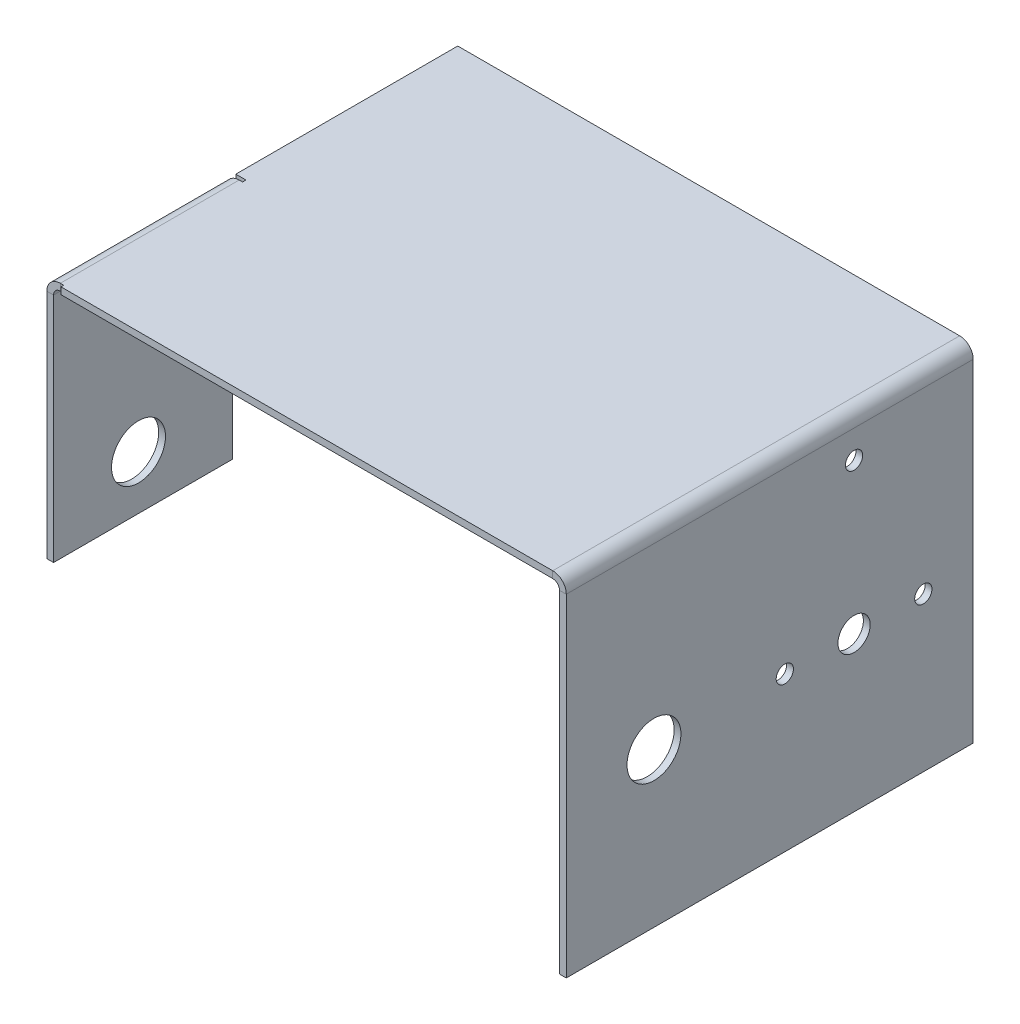
ISO-10303-21;
HEADER;
FILE_DESCRIPTION(('STEP AP214'),'2;1');
FILE_NAME('part.step','',(''),(''),'','','');
FILE_SCHEMA(('AUTOMOTIVE_DESIGN { 1 0 10303 214 1 1 1 1 }'));
ENDSEC;
DATA;
#1=APPLICATION_CONTEXT('core data for automotive mechanical design processes');
#2=APPLICATION_PROTOCOL_DEFINITION('international standard','automotive_design',2000,#1);
#3=PRODUCT_CONTEXT('',#1,'mechanical');
#4=PRODUCT('Part','Part','',(#3));
#5=PRODUCT_RELATED_PRODUCT_CATEGORY('part','',(#4));
#6=PRODUCT_DEFINITION_FORMATION('','',#4);
#7=PRODUCT_DEFINITION_CONTEXT('part definition',#1,'design');
#8=PRODUCT_DEFINITION('design','',#6,#7);
#9=PRODUCT_DEFINITION_SHAPE('','',#8);
#10=(LENGTH_UNIT() NAMED_UNIT(*) SI_UNIT(.MILLI.,.METRE.));
#11=(NAMED_UNIT(*) PLANE_ANGLE_UNIT() SI_UNIT($,.RADIAN.));
#12=(NAMED_UNIT(*) SI_UNIT($,.STERADIAN.) SOLID_ANGLE_UNIT());
#13=UNCERTAINTY_MEASURE_WITH_UNIT(LENGTH_MEASURE(1.E-05),#10,'distance_accuracy_value','');
#14=(GEOMETRIC_REPRESENTATION_CONTEXT(3) GLOBAL_UNCERTAINTY_ASSIGNED_CONTEXT((#13)) GLOBAL_UNIT_ASSIGNED_CONTEXT((#10,
#11,#12)) REPRESENTATION_CONTEXT('',''));
#15=CARTESIAN_POINT('',(0.,0.,0.));
#16=DIRECTION('',(0.,0.,1.));
#17=DIRECTION('',(1.,0.,0.));
#18=AXIS2_PLACEMENT_3D('',#15,#16,#17);
#19=CARTESIAN_POINT('',(0.,-1.,0.));
#20=DIRECTION('',(0.,1.,0.));
#21=DIRECTION('',(0.,0.,-1.));
#22=AXIS2_PLACEMENT_3D('',#19,#20,#21);
#23=PLANE('',#22);
#24=DIRECTION('',(0.,0.,-1.));
#25=VECTOR('',#24,1.);
#26=CARTESIAN_POINT('',(-36.,-0.99999999999999,30.094208410316));
#27=LINE('',#26,#25);
#28=CARTESIAN_POINT('',(-36.,-0.99999999999999,30.));
#29=VERTEX_POINT('',#28);
#30=CARTESIAN_POINT('',(-36.,-0.99999999999999,29.594208410316));
#31=VERTEX_POINT('',#30);
#32=EDGE_CURVE('E219',#29,#31,#27,.T.);
#33=ORIENTED_EDGE('',*,*,#32,.T.);
#34=DIRECTION('',(-1.,0.,0.));
#35=VECTOR('',#34,1.);
#36=CARTESIAN_POINT('',(-36.,-0.99999999999999,29.594208410316));
#37=LINE('',#36,#35);
#38=CARTESIAN_POINT('',(-36.5,-0.99999999999999,29.594208410316));
#39=VERTEX_POINT('',#38);
#40=EDGE_CURVE('E223',#31,#39,#37,.T.);
#41=ORIENTED_EDGE('',*,*,#40,.T.);
#42=DIRECTION('',(0.,0.,1.));
#43=VECTOR('',#42,1.);
#44=CARTESIAN_POINT('',(-36.5,-0.99999999999999,29.594208410316));
#45=LINE('',#44,#43);
#46=CARTESIAN_POINT('',(-36.5,-0.99999999999999,3.22486828633828));
#47=VERTEX_POINT('',#46);
#48=EDGE_CURVE('E209',#39,#47,#45,.F.);
#49=ORIENTED_EDGE('',*,*,#48,.T.);
#50=DIRECTION('',(1.,0.,0.));
#51=VECTOR('',#50,1.);
#52=CARTESIAN_POINT('',(-36.5,-0.99999999999999,3.22486828633828));
#53=LINE('',#52,#51);
#54=CARTESIAN_POINT('',(-36.,-0.99999999999999,3.22486828633828));
#55=VERTEX_POINT('',#54);
#56=EDGE_CURVE('E227',#47,#55,#53,.T.);
#57=ORIENTED_EDGE('',*,*,#56,.T.);
#58=DIRECTION('',(0.,0.,-1.));
#59=VECTOR('',#58,1.);
#60=CARTESIAN_POINT('',(-36.,-0.99999999999999,3.22486828633828));
#61=LINE('',#60,#59);
#62=CARTESIAN_POINT('',(-36.,-0.99999999999999,2.72486828633828));
#63=VERTEX_POINT('',#62);
#64=EDGE_CURVE('E230',#55,#63,#61,.T.);
#65=ORIENTED_EDGE('',*,*,#64,.T.);
#66=DIRECTION('',(-1.,0.,0.));
#67=VECTOR('',#66,1.);
#68=CARTESIAN_POINT('',(-36.,-0.99999999999999,2.72486828633828));
#69=LINE('',#68,#67);
#70=CARTESIAN_POINT('',(-37.5,-0.999999999999995,2.72486828633828));
#71=VERTEX_POINT('',#70);
#72=EDGE_CURVE('E234',#63,#71,#69,.T.);
#73=ORIENTED_EDGE('',*,*,#72,.T.);
#74=DIRECTION('',(0.,0.,-1.));
#75=VECTOR('',#74,1.);
#76=CARTESIAN_POINT('',(-37.5,-1.,-30.));
#77=LINE('',#76,#75);
#78=CARTESIAN_POINT('',(-37.5,-1.,-30.));
#79=VERTEX_POINT('',#78);
#80=EDGE_CURVE('E297',#71,#79,#77,.T.);
#81=ORIENTED_EDGE('',*,*,#80,.T.);
#82=DIRECTION('',(1.,0.,0.));
#83=VECTOR('',#82,1.);
#84=CARTESIAN_POINT('',(37.5,-1.,-30.));
#85=LINE('',#84,#83);
#86=CARTESIAN_POINT('',(36.5,-0.999999999999997,-30.));
#87=VERTEX_POINT('',#86);
#88=EDGE_CURVE('E300',#79,#87,#85,.T.);
#89=ORIENTED_EDGE('',*,*,#88,.T.);
#90=DIRECTION('',(0.,0.,-1.));
#91=VECTOR('',#90,1.);
#92=CARTESIAN_POINT('',(36.5,-0.999999999999997,-30.));
#93=LINE('',#92,#91);
#94=CARTESIAN_POINT('',(36.5,-0.999999999999997,30.));
#95=VERTEX_POINT('',#94);
#96=EDGE_CURVE('E288',#87,#95,#93,.F.);
#97=ORIENTED_EDGE('',*,*,#96,.T.);
#98=DIRECTION('',(-1.,0.,0.));
#99=VECTOR('',#98,1.);
#100=CARTESIAN_POINT('',(37.5,-1.,30.));
#101=LINE('',#100,#99);
#102=EDGE_CURVE('E304',#95,#29,#101,.T.);
#103=ORIENTED_EDGE('',*,*,#102,.T.);
#104=EDGE_LOOP('',(#33,#41,#49,#57,#65,#73,#81,#89,#97,#103));
#105=FACE_BOUND('',#104,.T.);
#106=ADVANCED_FACE('F38',(#105),#23,.F.);
#107=CARTESIAN_POINT('',(0.,0.,0.));
#108=DIRECTION('',(0.,1.,0.));
#109=DIRECTION('',(0.,0.,-1.));
#110=AXIS2_PLACEMENT_3D('',#107,#108,#109);
#111=PLANE('',#110);
#112=DIRECTION('',(-1.,0.,0.));
#113=VECTOR('',#112,1.);
#114=CARTESIAN_POINT('',(37.5,0.,30.));
#115=LINE('',#114,#113);
#116=CARTESIAN_POINT('',(36.5,0.,30.));
#117=VERTEX_POINT('',#116);
#118=CARTESIAN_POINT('',(-36.,0.,30.));
#119=VERTEX_POINT('',#118);
#120=EDGE_CURVE('E301',#117,#119,#115,.T.);
#121=ORIENTED_EDGE('',*,*,#120,.F.);
#122=DIRECTION('',(0.,0.,-1.));
#123=VECTOR('',#122,1.);
#124=CARTESIAN_POINT('',(36.5,0.,-30.));
#125=LINE('',#124,#123);
#126=CARTESIAN_POINT('',(36.5,0.,-30.));
#127=VERTEX_POINT('',#126);
#128=EDGE_CURVE('E278',#127,#117,#125,.F.);
#129=ORIENTED_EDGE('',*,*,#128,.F.);
#130=DIRECTION('',(1.,0.,0.));
#131=VECTOR('',#130,1.);
#132=CARTESIAN_POINT('',(37.5,0.,-30.));
#133=LINE('',#132,#131);
#134=CARTESIAN_POINT('',(-37.5,0.,-30.));
#135=VERTEX_POINT('',#134);
#136=EDGE_CURVE('E310',#135,#127,#133,.T.);
#137=ORIENTED_EDGE('',*,*,#136,.F.);
#138=DIRECTION('',(0.,0.,-1.));
#139=VECTOR('',#138,1.);
#140=CARTESIAN_POINT('',(-37.5,0.,-30.));
#141=LINE('',#140,#139);
#142=CARTESIAN_POINT('',(-37.5,0.,2.72486828633828));
#143=VERTEX_POINT('',#142);
#144=EDGE_CURVE('E294',#143,#135,#141,.T.);
#145=ORIENTED_EDGE('',*,*,#144,.F.);
#146=DIRECTION('',(-1.,0.,0.));
#147=VECTOR('',#146,1.);
#148=CARTESIAN_POINT('',(0.,0.,2.72486828633825));
#149=LINE('',#148,#147);
#150=CARTESIAN_POINT('',(-36.,0.,2.72486828633828));
#151=VERTEX_POINT('',#150);
#152=EDGE_CURVE('E243',#151,#143,#149,.T.);
#153=ORIENTED_EDGE('',*,*,#152,.F.);
#154=DIRECTION('',(0.,0.,-1.));
#155=VECTOR('',#154,1.);
#156=CARTESIAN_POINT('',(-36.,0.,0.));
#157=LINE('',#156,#155);
#158=CARTESIAN_POINT('',(-36.,0.,3.22486828633828));
#159=VERTEX_POINT('',#158);
#160=EDGE_CURVE('E317',#159,#151,#157,.T.);
#161=ORIENTED_EDGE('',*,*,#160,.F.);
#162=DIRECTION('',(1.,0.,0.));
#163=VECTOR('',#162,1.);
#164=CARTESIAN_POINT('',(0.,0.,3.22486828633828));
#165=LINE('',#164,#163);
#166=CARTESIAN_POINT('',(-36.5,0.,3.22486828633828));
#167=VERTEX_POINT('',#166);
#168=EDGE_CURVE('E47',#167,#159,#165,.T.);
#169=ORIENTED_EDGE('',*,*,#168,.F.);
#170=DIRECTION('',(0.,0.,1.));
#171=VECTOR('',#170,1.);
#172=CARTESIAN_POINT('',(-36.5,0.,29.594208410316));
#173=LINE('',#172,#171);
#174=CARTESIAN_POINT('',(-36.5,0.,29.594208410316));
#175=VERTEX_POINT('',#174);
#176=EDGE_CURVE('E198',#175,#167,#173,.F.);
#177=ORIENTED_EDGE('',*,*,#176,.F.);
#178=DIRECTION('',(-1.,0.,0.));
#179=VECTOR('',#178,1.);
#180=CARTESIAN_POINT('',(0.,0.,29.594208410316));
#181=LINE('',#180,#179);
#182=CARTESIAN_POINT('',(-36.,0.,29.594208410316));
#183=VERTEX_POINT('',#182);
#184=EDGE_CURVE('E11',#183,#175,#181,.T.);
#185=ORIENTED_EDGE('',*,*,#184,.F.);
#186=DIRECTION('',(0.,0.,-1.));
#187=VECTOR('',#186,1.);
#188=CARTESIAN_POINT('',(-36.,0.,0.));
#189=LINE('',#188,#187);
#190=EDGE_CURVE('E222',#119,#183,#189,.T.);
#191=ORIENTED_EDGE('',*,*,#190,.F.);
#192=EDGE_LOOP('',(#121,#129,#137,#145,#153,#161,#169,#177,#185,#191));
#193=FACE_BOUND('',#192,.T.);
#194=ADVANCED_FACE('F390',(#193),#111,.T.);
#195=CARTESIAN_POINT('',(-37.5,-1.,-30.));
#196=DIRECTION('',(-1.,0.,0.));
#197=DIRECTION('',(0.,0.,-1.));
#198=AXIS2_PLACEMENT_3D('',#195,#196,#197);
#199=PLANE('',#198);
#200=ORIENTED_EDGE('',*,*,#144,.T.);
#201=DIRECTION('',(0.,1.,0.));
#202=VECTOR('',#201,1.);
#203=CARTESIAN_POINT('',(-37.5,-1.,-30.));
#204=LINE('',#203,#202);
#205=EDGE_CURVE('E307',#79,#135,#204,.T.);
#206=ORIENTED_EDGE('',*,*,#205,.F.);
#207=ORIENTED_EDGE('',*,*,#80,.F.);
#208=DIRECTION('',(0.,1.,0.));
#209=VECTOR('',#208,1.);
#210=CARTESIAN_POINT('',(-37.5,-0.999999999999995,2.72486828633828));
#211=LINE('',#210,#209);
#212=EDGE_CURVE('E237',#71,#143,#211,.T.);
#213=ORIENTED_EDGE('',*,*,#212,.T.);
#214=EDGE_LOOP('',(#200,#206,#207,#213));
#215=FACE_BOUND('',#214,.T.);
#216=ADVANCED_FACE('F40',(#215),#199,.T.);
#217=CARTESIAN_POINT('',(37.5,-1.,30.));
#218=DIRECTION('',(0.,0.,1.));
#219=DIRECTION('',(-1.,0.,0.));
#220=AXIS2_PLACEMENT_3D('',#217,#218,#219);
#221=PLANE('',#220);
#222=ORIENTED_EDGE('',*,*,#102,.F.);
#223=DIRECTION('',(0.,1.,0.));
#224=VECTOR('',#223,1.);
#225=CARTESIAN_POINT('',(36.5,-0.999999999999997,30.));
#226=LINE('',#225,#224);
#227=EDGE_CURVE('E292',#95,#117,#226,.T.);
#228=ORIENTED_EDGE('',*,*,#227,.T.);
#229=ORIENTED_EDGE('',*,*,#120,.T.);
#230=DIRECTION('',(0.,1.,0.));
#231=VECTOR('',#230,1.);
#232=CARTESIAN_POINT('',(-36.,-1.,30.));
#233=LINE('',#232,#231);
#234=EDGE_CURVE('E55',#29,#119,#233,.T.);
#235=ORIENTED_EDGE('',*,*,#234,.F.);
#236=EDGE_LOOP('',(#222,#228,#229,#235));
#237=FACE_BOUND('',#236,.T.);
#238=ADVANCED_FACE('F426',(#237),#221,.T.);
#239=CARTESIAN_POINT('',(37.5,-1.,-30.));
#240=DIRECTION('',(0.,0.,-1.));
#241=DIRECTION('',(1.,0.,0.));
#242=AXIS2_PLACEMENT_3D('',#239,#240,#241);
#243=PLANE('',#242);
#244=ORIENTED_EDGE('',*,*,#88,.F.);
#245=ORIENTED_EDGE('',*,*,#205,.T.);
#246=ORIENTED_EDGE('',*,*,#136,.T.);
#247=DIRECTION('',(0.,1.,0.));
#248=VECTOR('',#247,1.);
#249=CARTESIAN_POINT('',(36.5,-0.999999999999997,-30.));
#250=LINE('',#249,#248);
#251=EDGE_CURVE('E283',#87,#127,#250,.T.);
#252=ORIENTED_EDGE('',*,*,#251,.F.);
#253=EDGE_LOOP('',(#244,#245,#246,#252));
#254=FACE_BOUND('',#253,.T.);
#255=ADVANCED_FACE('F413',(#254),#243,.T.);
#256=CARTESIAN_POINT('',(36.5,-2.,30.));
#257=DIRECTION('',(0.,0.,1.));
#258=DIRECTION('',(-1.,0.,0.));
#259=AXIS2_PLACEMENT_3D('',#256,#257,#258);
#260=PLANE('',#259);
#261=DIRECTION('',(1.,0.,0.));
#262=VECTOR('',#261,1.);
#263=CARTESIAN_POINT('',(37.5,-1.99999999999999,30.));
#264=LINE('',#263,#262);
#265=CARTESIAN_POINT('',(37.5,-1.99999999999999,30.));
#266=VERTEX_POINT('',#265);
#267=CARTESIAN_POINT('',(38.5,-1.99999999999999,30.));
#268=VERTEX_POINT('',#267);
#269=EDGE_CURVE('E246',#266,#268,#264,.T.);
#270=ORIENTED_EDGE('',*,*,#269,.T.);
#271=CARTESIAN_POINT('',(36.5,-2.,30.));
#272=DIRECTION('',(0.,0.,1.));
#273=DIRECTION('',(1.,0.,0.));
#274=AXIS2_PLACEMENT_3D('',#271,#272,#273);
#275=CIRCLE('',#274,2.);
#276=EDGE_CURVE('E63',#117,#268,#275,.F.);
#277=ORIENTED_EDGE('',*,*,#276,.F.);
#278=ORIENTED_EDGE('',*,*,#227,.F.);
#279=CARTESIAN_POINT('',(36.5,-2.,30.));
#280=DIRECTION('',(0.,0.,1.));
#281=DIRECTION('',(1.,0.,0.));
#282=AXIS2_PLACEMENT_3D('',#279,#280,#281);
#283=CIRCLE('',#282,1.);
#284=EDGE_CURVE('E285',#95,#266,#283,.F.);
#285=ORIENTED_EDGE('',*,*,#284,.T.);
#286=EDGE_LOOP('',(#270,#277,#278,#285));
#287=FACE_BOUND('',#286,.T.);
#288=ADVANCED_FACE('F424',(#287),#260,.T.);
#289=CARTESIAN_POINT('',(36.5,-2.,-30.));
#290=DIRECTION('',(0.,0.,1.));
#291=DIRECTION('',(-1.,0.,0.));
#292=AXIS2_PLACEMENT_3D('',#289,#290,#291);
#293=PLANE('',#292);
#294=CARTESIAN_POINT('',(36.5,-2.,-30.));
#295=DIRECTION('',(0.,0.,1.));
#296=DIRECTION('',(1.,0.,0.));
#297=AXIS2_PLACEMENT_3D('',#294,#295,#296);
#298=CIRCLE('',#297,1.);
#299=CARTESIAN_POINT('',(37.5,-1.99999999999999,-30.));
#300=VERTEX_POINT('',#299);
#301=EDGE_CURVE('E275',#300,#87,#298,.T.);
#302=ORIENTED_EDGE('',*,*,#301,.T.);
#303=ORIENTED_EDGE('',*,*,#251,.T.);
#304=CARTESIAN_POINT('',(36.5,-2.,-30.));
#305=DIRECTION('',(0.,0.,1.));
#306=DIRECTION('',(1.,0.,0.));
#307=AXIS2_PLACEMENT_3D('',#304,#305,#306);
#308=CIRCLE('',#307,2.);
#309=CARTESIAN_POINT('',(38.5,-1.99999999999999,-30.));
#310=VERTEX_POINT('',#309);
#311=EDGE_CURVE('E281',#310,#127,#308,.T.);
#312=ORIENTED_EDGE('',*,*,#311,.F.);
#313=DIRECTION('',(1.,0.,0.));
#314=VECTOR('',#313,1.);
#315=CARTESIAN_POINT('',(37.5,-1.99999999999999,-30.));
#316=LINE('',#315,#314);
#317=EDGE_CURVE('E250',#300,#310,#316,.T.);
#318=ORIENTED_EDGE('',*,*,#317,.F.);
#319=EDGE_LOOP('',(#302,#303,#312,#318));
#320=FACE_BOUND('',#319,.T.);
#321=ADVANCED_FACE('F432',(#320),#293,.F.);
#322=CARTESIAN_POINT('',(36.5,-2.,-30.));
#323=DIRECTION('',(0.,0.,-1.));
#324=DIRECTION('',(1.,0.,0.));
#325=AXIS2_PLACEMENT_3D('',#322,#323,#324);
#326=CYLINDRICAL_SURFACE('',#325,2.);
#327=ORIENTED_EDGE('',*,*,#128,.T.);
#328=ORIENTED_EDGE('',*,*,#276,.T.);
#329=DIRECTION('',(0.,0.,-1.));
#330=VECTOR('',#329,1.);
#331=CARTESIAN_POINT('',(38.5,-1.99999999999999,0.));
#332=LINE('',#331,#330);
#333=EDGE_CURVE('E253',#268,#310,#332,.T.);
#334=ORIENTED_EDGE('',*,*,#333,.T.);
#335=ORIENTED_EDGE('',*,*,#311,.T.);
#336=EDGE_LOOP('',(#327,#328,#334,#335));
#337=FACE_BOUND('',#336,.T.);
#338=ADVANCED_FACE('F429',(#337),#326,.T.);
#339=CARTESIAN_POINT('',(36.5,-2.,-30.));
#340=DIRECTION('',(0.,0.,-1.));
#341=DIRECTION('',(1.,0.,0.));
#342=AXIS2_PLACEMENT_3D('',#339,#340,#341);
#343=CYLINDRICAL_SURFACE('',#342,1.);
#344=ORIENTED_EDGE('',*,*,#96,.F.);
#345=ORIENTED_EDGE('',*,*,#301,.F.);
#346=DIRECTION('',(0.,0.,-1.));
#347=VECTOR('',#346,1.);
#348=CARTESIAN_POINT('',(37.5,-1.99999999999999,30.));
#349=LINE('',#348,#347);
#350=EDGE_CURVE('E247',#266,#300,#349,.T.);
#351=ORIENTED_EDGE('',*,*,#350,.F.);
#352=ORIENTED_EDGE('',*,*,#284,.F.);
#353=EDGE_LOOP('',(#344,#345,#351,#352));
#354=FACE_BOUND('',#353,.T.);
#355=ADVANCED_FACE('F420',(#354),#343,.F.);
#356=CARTESIAN_POINT('',(38.5,-0.999999999999997,-30.));
#357=DIRECTION('',(0.,0.,-1.));
#358=DIRECTION('',(0.,-1.,0.));
#359=AXIS2_PLACEMENT_3D('',#356,#357,#358);
#360=PLANE('',#359);
#361=DIRECTION('',(0.,1.,0.));
#362=VECTOR('',#361,1.);
#363=CARTESIAN_POINT('',(38.5,-0.999999999999997,-30.));
#364=LINE('',#363,#362);
#365=CARTESIAN_POINT('',(38.5000000000002,-51.,-30.));
#366=VERTEX_POINT('',#365);
#367=EDGE_CURVE('E264',#366,#310,#364,.T.);
#368=ORIENTED_EDGE('',*,*,#367,.F.);
#369=DIRECTION('',(-1.,0.,0.));
#370=VECTOR('',#369,1.);
#371=CARTESIAN_POINT('',(38.5000000000002,-51.,-30.));
#372=LINE('',#371,#370);
#373=CARTESIAN_POINT('',(37.5000000000002,-51.,-30.));
#374=VERTEX_POINT('',#373);
#375=EDGE_CURVE('E272',#366,#374,#372,.T.);
#376=ORIENTED_EDGE('',*,*,#375,.T.);
#377=DIRECTION('',(0.,1.,0.));
#378=VECTOR('',#377,1.);
#379=CARTESIAN_POINT('',(37.5,-1.,-30.));
#380=LINE('',#379,#378);
#381=EDGE_CURVE('E262',#374,#300,#380,.T.);
#382=ORIENTED_EDGE('',*,*,#381,.T.);
#383=ORIENTED_EDGE('',*,*,#317,.T.);
#384=EDGE_LOOP('',(#368,#376,#382,#383));
#385=FACE_BOUND('',#384,.T.);
#386=ADVANCED_FACE('F435',(#385),#360,.T.);
#387=CARTESIAN_POINT('',(38.5000000000002,-51.,30.));
#388=DIRECTION('',(0.,0.,1.));
#389=DIRECTION('',(0.,1.,0.));
#390=AXIS2_PLACEMENT_3D('',#387,#388,#389);
#391=PLANE('',#390);
#392=DIRECTION('',(0.,-1.,0.));
#393=VECTOR('',#392,1.);
#394=CARTESIAN_POINT('',(37.5000000000002,-51.,30.));
#395=LINE('',#394,#393);
#396=CARTESIAN_POINT('',(37.5000000000002,-51.,30.));
#397=VERTEX_POINT('',#396);
#398=EDGE_CURVE('E257',#266,#397,#395,.T.);
#399=ORIENTED_EDGE('',*,*,#398,.T.);
#400=DIRECTION('',(-1.,0.,0.));
#401=VECTOR('',#400,1.);
#402=CARTESIAN_POINT('',(38.5000000000002,-51.,30.));
#403=LINE('',#402,#401);
#404=CARTESIAN_POINT('',(38.5000000000002,-51.,30.));
#405=VERTEX_POINT('',#404);
#406=EDGE_CURVE('E266',#405,#397,#403,.T.);
#407=ORIENTED_EDGE('',*,*,#406,.F.);
#408=DIRECTION('',(0.,-1.,0.));
#409=VECTOR('',#408,1.);
#410=CARTESIAN_POINT('',(38.5000000000002,-51.,30.));
#411=LINE('',#410,#409);
#412=EDGE_CURVE('E258',#268,#405,#411,.T.);
#413=ORIENTED_EDGE('',*,*,#412,.F.);
#414=ORIENTED_EDGE('',*,*,#269,.F.);
#415=EDGE_LOOP('',(#399,#407,#413,#414));
#416=FACE_BOUND('',#415,.T.);
#417=ADVANCED_FACE('F442',(#416),#391,.T.);
#418=CARTESIAN_POINT('',(38.5,1.33595742037104E-13,0.));
#419=DIRECTION('',(1.,0.,0.));
#420=DIRECTION('',(0.,1.,0.));
#421=AXIS2_PLACEMENT_3D('',#418,#419,#420);
#422=PLANE('',#421);
#423=CARTESIAN_POINT('',(38.5000000000001,-28.2877300000001,17.0691799999999));
#424=DIRECTION('',(-1.,0.,0.));
#425=DIRECTION('',(0.,1.,0.));
#426=AXIS2_PLACEMENT_3D('',#423,#424,#425);
#427=CIRCLE('',#426,3.975);
#428=CARTESIAN_POINT('',(38.5000000000001,-24.3127300000001,17.0691799999999));
#429=VERTEX_POINT('',#428);
#430=EDGE_CURVE('E544',#429,#429,#427,.T.);
#431=ORIENTED_EDGE('',*,*,#430,.T.);
#432=EDGE_LOOP('',(#431));
#433=FACE_BOUND('',#432,.T.);
#434=CARTESIAN_POINT('',(38.5,-6.11353000000009,-12.4308200000001));
#435=DIRECTION('',(-1.,0.,0.));
#436=DIRECTION('',(0.,1.,0.));
#437=AXIS2_PLACEMENT_3D('',#434,#435,#436);
#438=CIRCLE('',#437,1.27);
#439=CARTESIAN_POINT('',(38.5,-4.84353000000009,-12.4308200000001));
#440=VERTEX_POINT('',#439);
#441=EDGE_CURVE('E336',#440,#440,#438,.T.);
#442=ORIENTED_EDGE('',*,*,#441,.T.);
#443=EDGE_LOOP('',(#442));
#444=FACE_BOUND('',#443,.T.);
#445=CARTESIAN_POINT('',(38.5000000000001,-28.2877300000001,-2.22002000000015));
#446=DIRECTION('',(-1.,0.,0.));
#447=DIRECTION('',(0.,1.,0.));
#448=AXIS2_PLACEMENT_3D('',#445,#446,#447);
#449=CIRCLE('',#448,1.27);
#450=CARTESIAN_POINT('',(38.5000000000001,-27.0177300000001,-2.22002000000015));
#451=VERTEX_POINT('',#450);
#452=EDGE_CURVE('E333',#451,#451,#449,.T.);
#453=ORIENTED_EDGE('',*,*,#452,.T.);
#454=EDGE_LOOP('',(#453));
#455=FACE_BOUND('',#454,.T.);
#456=CARTESIAN_POINT('',(38.5000000000001,-28.2877300000001,-12.4308200000001));
#457=DIRECTION('',(-1.,0.,0.));
#458=DIRECTION('',(0.,1.,0.));
#459=AXIS2_PLACEMENT_3D('',#456,#457,#458);
#460=CIRCLE('',#459,2.3749);
#461=CARTESIAN_POINT('',(38.5000000000001,-25.9128300000001,-12.4308200000001));
#462=VERTEX_POINT('',#461);
#463=EDGE_CURVE('E330',#462,#462,#460,.T.);
#464=ORIENTED_EDGE('',*,*,#463,.T.);
#465=EDGE_LOOP('',(#464));
#466=FACE_BOUND('',#465,.T.);
#467=CARTESIAN_POINT('',(38.5000000000001,-28.2877300000001,-22.6416200000001));
#468=DIRECTION('',(-1.,0.,0.));
#469=DIRECTION('',(0.,1.,0.));
#470=AXIS2_PLACEMENT_3D('',#467,#468,#469);
#471=CIRCLE('',#470,1.27);
#472=CARTESIAN_POINT('',(38.5000000000001,-27.0177300000001,-22.6416200000001));
#473=VERTEX_POINT('',#472);
#474=EDGE_CURVE('E326',#473,#473,#471,.T.);
#475=ORIENTED_EDGE('',*,*,#474,.T.);
#476=EDGE_LOOP('',(#475));
#477=FACE_BOUND('',#476,.T.);
#478=ORIENTED_EDGE('',*,*,#412,.T.);
#479=DIRECTION('',(0.,0.,-1.));
#480=VECTOR('',#479,1.);
#481=CARTESIAN_POINT('',(38.5000000000002,-51.,-30.));
#482=LINE('',#481,#480);
#483=EDGE_CURVE('E261',#405,#366,#482,.T.);
#484=ORIENTED_EDGE('',*,*,#483,.T.);
#485=ORIENTED_EDGE('',*,*,#367,.T.);
#486=ORIENTED_EDGE('',*,*,#333,.F.);
#487=EDGE_LOOP('',(#478,#484,#485,#486));
#488=FACE_BOUND('',#487,.T.);
#489=ADVANCED_FACE('F444',(#433,#444,#455,#466,#477,#488),#422,.T.);
#490=CARTESIAN_POINT('',(37.5,1.3010426069826E-13,0.));
#491=DIRECTION('',(1.,0.,0.));
#492=DIRECTION('',(0.,1.,0.));
#493=AXIS2_PLACEMENT_3D('',#490,#491,#492);
#494=PLANE('',#493);
#495=CARTESIAN_POINT('',(37.5000000000001,-28.2877300000001,17.0691799999999));
#496=DIRECTION('',(-1.,0.,0.));
#497=DIRECTION('',(0.,1.,0.));
#498=AXIS2_PLACEMENT_3D('',#495,#496,#497);
#499=CIRCLE('',#498,3.975);
#500=CARTESIAN_POINT('',(37.5000000000001,-24.3127300000001,17.0691799999999));
#501=VERTEX_POINT('',#500);
#502=EDGE_CURVE('E342',#501,#501,#499,.T.);
#503=ORIENTED_EDGE('',*,*,#502,.F.);
#504=EDGE_LOOP('',(#503));
#505=FACE_BOUND('',#504,.T.);
#506=CARTESIAN_POINT('',(37.5,-6.1135300000001,-12.4308200000001));
#507=DIRECTION('',(-1.,0.,0.));
#508=DIRECTION('',(0.,1.,0.));
#509=AXIS2_PLACEMENT_3D('',#506,#507,#508);
#510=CIRCLE('',#509,1.27);
#511=CARTESIAN_POINT('',(37.5,-4.8435300000001,-12.4308200000001));
#512=VERTEX_POINT('',#511);
#513=EDGE_CURVE('E334',#512,#512,#510,.T.);
#514=ORIENTED_EDGE('',*,*,#513,.F.);
#515=EDGE_LOOP('',(#514));
#516=FACE_BOUND('',#515,.T.);
#517=CARTESIAN_POINT('',(37.5000000000001,-28.2877300000001,-2.22002000000015));
#518=DIRECTION('',(-1.,0.,0.));
#519=DIRECTION('',(0.,1.,0.));
#520=AXIS2_PLACEMENT_3D('',#517,#518,#519);
#521=CIRCLE('',#520,1.27);
#522=CARTESIAN_POINT('',(37.5000000000001,-27.0177300000001,-2.22002000000015));
#523=VERTEX_POINT('',#522);
#524=EDGE_CURVE('E331',#523,#523,#521,.T.);
#525=ORIENTED_EDGE('',*,*,#524,.F.);
#526=EDGE_LOOP('',(#525));
#527=FACE_BOUND('',#526,.T.);
#528=CARTESIAN_POINT('',(37.5000000000001,-28.2877300000001,-12.4308200000001));
#529=DIRECTION('',(-1.,0.,0.));
#530=DIRECTION('',(0.,1.,0.));
#531=AXIS2_PLACEMENT_3D('',#528,#529,#530);
#532=CIRCLE('',#531,2.3749);
#533=CARTESIAN_POINT('',(37.5000000000001,-25.9128300000001,-12.4308200000001));
#534=VERTEX_POINT('',#533);
#535=EDGE_CURVE('E327',#534,#534,#532,.T.);
#536=ORIENTED_EDGE('',*,*,#535,.F.);
#537=EDGE_LOOP('',(#536));
#538=FACE_BOUND('',#537,.T.);
#539=CARTESIAN_POINT('',(37.5000000000001,-28.2877300000001,-22.6416200000001));
#540=DIRECTION('',(-1.,0.,0.));
#541=DIRECTION('',(0.,1.,0.));
#542=AXIS2_PLACEMENT_3D('',#539,#540,#541);
#543=CIRCLE('',#542,1.27);
#544=CARTESIAN_POINT('',(37.5000000000001,-27.0177300000001,-22.6416200000001));
#545=VERTEX_POINT('',#544);
#546=EDGE_CURVE('E322',#545,#545,#543,.T.);
#547=ORIENTED_EDGE('',*,*,#546,.F.);
#548=EDGE_LOOP('',(#547));
#549=FACE_BOUND('',#548,.T.);
#550=ORIENTED_EDGE('',*,*,#350,.T.);
#551=ORIENTED_EDGE('',*,*,#381,.F.);
#552=DIRECTION('',(0.,0.,-1.));
#553=VECTOR('',#552,1.);
#554=CARTESIAN_POINT('',(37.5000000000002,-51.,-30.));
#555=LINE('',#554,#553);
#556=EDGE_CURVE('E269',#397,#374,#555,.T.);
#557=ORIENTED_EDGE('',*,*,#556,.F.);
#558=ORIENTED_EDGE('',*,*,#398,.F.);
#559=EDGE_LOOP('',(#550,#551,#557,#558));
#560=FACE_BOUND('',#559,.T.);
#561=ADVANCED_FACE('F439',(#505,#516,#527,#538,#549,#560),#494,.F.);
#562=CARTESIAN_POINT('',(38.5000000000002,-51.,-30.));
#563=DIRECTION('',(0.,-1.,0.));
#564=DIRECTION('',(1.,0.,0.));
#565=AXIS2_PLACEMENT_3D('',#562,#563,#564);
#566=PLANE('',#565);
#567=ORIENTED_EDGE('',*,*,#556,.T.);
#568=ORIENTED_EDGE('',*,*,#375,.F.);
#569=ORIENTED_EDGE('',*,*,#483,.F.);
#570=ORIENTED_EDGE('',*,*,#406,.T.);
#571=EDGE_LOOP('',(#567,#568,#569,#570));
#572=FACE_BOUND('',#571,.T.);
#573=ADVANCED_FACE('F446',(#572),#566,.T.);
#574=CARTESIAN_POINT('',(-36.,-0.99999999999999,30.094208410316));
#575=DIRECTION('',(-1.,0.,0.));
#576=DIRECTION('',(0.,0.,-1.));
#577=AXIS2_PLACEMENT_3D('',#574,#575,#576);
#578=PLANE('',#577);
#579=ORIENTED_EDGE('',*,*,#190,.T.);
#580=DIRECTION('',(0.,1.,0.));
#581=VECTOR('',#580,1.);
#582=CARTESIAN_POINT('',(-36.,-0.99999999999999,29.594208410316));
#583=LINE('',#582,#581);
#584=EDGE_CURVE('E226',#31,#183,#583,.T.);
#585=ORIENTED_EDGE('',*,*,#584,.F.);
#586=ORIENTED_EDGE('',*,*,#32,.F.);
#587=ORIENTED_EDGE('',*,*,#234,.T.);
#588=EDGE_LOOP('',(#579,#585,#586,#587));
#589=FACE_BOUND('',#588,.T.);
#590=ADVANCED_FACE('F427',(#589),#578,.T.);
#591=CARTESIAN_POINT('',(-36.,-0.99999999999999,29.594208410316));
#592=DIRECTION('',(0.,0.,1.));
#593=DIRECTION('',(0.,1.,0.));
#594=AXIS2_PLACEMENT_3D('',#591,#592,#593);
#595=PLANE('',#594);
#596=ORIENTED_EDGE('',*,*,#184,.T.);
#597=DIRECTION('',(0.,1.,0.));
#598=VECTOR('',#597,1.);
#599=CARTESIAN_POINT('',(-36.5,-0.99999999999999,29.594208410316));
#600=LINE('',#599,#598);
#601=EDGE_CURVE('E204',#39,#175,#600,.T.);
#602=ORIENTED_EDGE('',*,*,#601,.F.);
#603=ORIENTED_EDGE('',*,*,#40,.F.);
#604=ORIENTED_EDGE('',*,*,#584,.T.);
#605=EDGE_LOOP('',(#596,#602,#603,#604));
#606=FACE_BOUND('',#605,.T.);
#607=ADVANCED_FACE('F384',(#606),#595,.T.);
#608=CARTESIAN_POINT('',(-36.5,-0.99999999999999,3.22486828633828));
#609=DIRECTION('',(0.,0.,-1.));
#610=DIRECTION('',(0.,-1.,0.));
#611=AXIS2_PLACEMENT_3D('',#608,#609,#610);
#612=PLANE('',#611);
#613=ORIENTED_EDGE('',*,*,#168,.T.);
#614=DIRECTION('',(0.,1.,0.));
#615=VECTOR('',#614,1.);
#616=CARTESIAN_POINT('',(-36.,-0.99999999999999,3.22486828633828));
#617=LINE('',#616,#615);
#618=EDGE_CURVE('E233',#55,#159,#617,.T.);
#619=ORIENTED_EDGE('',*,*,#618,.F.);
#620=ORIENTED_EDGE('',*,*,#56,.F.);
#621=DIRECTION('',(0.,1.,0.));
#622=VECTOR('',#621,1.);
#623=CARTESIAN_POINT('',(-36.5,-0.99999999999999,3.22486828633828));
#624=LINE('',#623,#622);
#625=EDGE_CURVE('E213',#47,#167,#624,.T.);
#626=ORIENTED_EDGE('',*,*,#625,.T.);
#627=EDGE_LOOP('',(#613,#619,#620,#626));
#628=FACE_BOUND('',#627,.T.);
#629=ADVANCED_FACE('F398',(#628),#612,.T.);
#630=CARTESIAN_POINT('',(-36.,-0.99999999999999,3.22486828633828));
#631=DIRECTION('',(-1.,0.,0.));
#632=DIRECTION('',(0.,0.,-1.));
#633=AXIS2_PLACEMENT_3D('',#630,#631,#632);
#634=PLANE('',#633);
#635=ORIENTED_EDGE('',*,*,#160,.T.);
#636=DIRECTION('',(0.,1.,0.));
#637=VECTOR('',#636,1.);
#638=CARTESIAN_POINT('',(-36.,-0.99999999999999,2.72486828633828));
#639=LINE('',#638,#637);
#640=EDGE_CURVE('E216',#63,#151,#639,.T.);
#641=ORIENTED_EDGE('',*,*,#640,.F.);
#642=ORIENTED_EDGE('',*,*,#64,.F.);
#643=ORIENTED_EDGE('',*,*,#618,.T.);
#644=EDGE_LOOP('',(#635,#641,#642,#643));
#645=FACE_BOUND('',#644,.T.);
#646=ADVANCED_FACE('F402',(#645),#634,.T.);
#647=CARTESIAN_POINT('',(-36.,-0.99999999999999,2.72486828633828));
#648=DIRECTION('',(0.,0.,1.));
#649=DIRECTION('',(-1.,0.,0.));
#650=AXIS2_PLACEMENT_3D('',#647,#648,#649);
#651=PLANE('',#650);
#652=ORIENTED_EDGE('',*,*,#152,.T.);
#653=ORIENTED_EDGE('',*,*,#212,.F.);
#654=ORIENTED_EDGE('',*,*,#72,.F.);
#655=ORIENTED_EDGE('',*,*,#640,.T.);
#656=EDGE_LOOP('',(#652,#653,#654,#655));
#657=FACE_BOUND('',#656,.T.);
#658=ADVANCED_FACE('F405',(#657),#651,.T.);
#659=CARTESIAN_POINT('',(-36.5,-2.,3.22486828633828));
#660=DIRECTION('',(0.,0.,-1.));
#661=DIRECTION('',(1.,0.,0.));
#662=AXIS2_PLACEMENT_3D('',#659,#660,#661);
#663=PLANE('',#662);
#664=DIRECTION('',(-1.,0.,0.));
#665=VECTOR('',#664,1.);
#666=CARTESIAN_POINT('',(-37.5,-1.99999999999999,3.22486828633828));
#667=LINE('',#666,#665);
#668=CARTESIAN_POINT('',(-37.5,-1.99999999999999,3.22486828633828));
#669=VERTEX_POINT('',#668);
#670=CARTESIAN_POINT('',(-38.5,-1.99999999999999,3.22486828633828));
#671=VERTEX_POINT('',#670);
#672=EDGE_CURVE('E325',#669,#671,#667,.T.);
#673=ORIENTED_EDGE('',*,*,#672,.T.);
#674=CARTESIAN_POINT('',(-36.5,-2.,3.22486828633828));
#675=DIRECTION('',(0.,0.,-1.));
#676=DIRECTION('',(-1.,0.,0.));
#677=AXIS2_PLACEMENT_3D('',#674,#675,#676);
#678=CIRCLE('',#677,2.00000000000001);
#679=EDGE_CURVE('E201',#167,#671,#678,.F.);
#680=ORIENTED_EDGE('',*,*,#679,.F.);
#681=ORIENTED_EDGE('',*,*,#625,.F.);
#682=CARTESIAN_POINT('',(-36.5,-2.,3.22486828633828));
#683=DIRECTION('',(0.,0.,-1.));
#684=DIRECTION('',(-1.,0.,0.));
#685=AXIS2_PLACEMENT_3D('',#682,#683,#684);
#686=CIRCLE('',#685,1.00000000000001);
#687=EDGE_CURVE('E206',#47,#669,#686,.F.);
#688=ORIENTED_EDGE('',*,*,#687,.T.);
#689=EDGE_LOOP('',(#673,#680,#681,#688));
#690=FACE_BOUND('',#689,.T.);
#691=ADVANCED_FACE('F395',(#690),#663,.T.);
#692=CARTESIAN_POINT('',(-36.5,-2.,29.594208410316));
#693=DIRECTION('',(0.,0.,-1.));
#694=DIRECTION('',(1.,0.,0.));
#695=AXIS2_PLACEMENT_3D('',#692,#693,#694);
#696=PLANE('',#695);
#697=CARTESIAN_POINT('',(-36.5,-2.,29.594208410316));
#698=DIRECTION('',(0.,0.,-1.));
#699=DIRECTION('',(-1.,0.,0.));
#700=AXIS2_PLACEMENT_3D('',#697,#698,#699);
#701=CIRCLE('',#700,1.00000000000001);
#702=CARTESIAN_POINT('',(-37.5,-1.99999999999999,29.594208410316));
#703=VERTEX_POINT('',#702);
#704=EDGE_CURVE('E193',#703,#39,#701,.T.);
#705=ORIENTED_EDGE('',*,*,#704,.T.);
#706=ORIENTED_EDGE('',*,*,#601,.T.);
#707=CARTESIAN_POINT('',(-36.5,-2.,29.594208410316));
#708=DIRECTION('',(0.,0.,-1.));
#709=DIRECTION('',(-1.,0.,0.));
#710=AXIS2_PLACEMENT_3D('',#707,#708,#709);
#711=CIRCLE('',#710,2.00000000000001);
#712=CARTESIAN_POINT('',(-38.5,-1.99999999999999,29.594208410316));
#713=VERTEX_POINT('',#712);
#714=EDGE_CURVE('E202',#713,#175,#711,.T.);
#715=ORIENTED_EDGE('',*,*,#714,.F.);
#716=DIRECTION('',(-1.,0.,0.));
#717=VECTOR('',#716,1.);
#718=CARTESIAN_POINT('',(-37.5,-1.99999999999999,29.594208410316));
#719=LINE('',#718,#717);
#720=EDGE_CURVE('E357',#703,#713,#719,.T.);
#721=ORIENTED_EDGE('',*,*,#720,.F.);
#722=EDGE_LOOP('',(#705,#706,#715,#721));
#723=FACE_BOUND('',#722,.T.);
#724=ADVANCED_FACE('F376',(#723),#696,.F.);
#725=CARTESIAN_POINT('',(-36.5,-2.,29.594208410316));
#726=DIRECTION('',(0.,0.,1.));
#727=DIRECTION('',(-1.,0.,0.));
#728=AXIS2_PLACEMENT_3D('',#725,#726,#727);
#729=CYLINDRICAL_SURFACE('',#728,2.00000000000001);
#730=ORIENTED_EDGE('',*,*,#176,.T.);
#731=ORIENTED_EDGE('',*,*,#679,.T.);
#732=DIRECTION('',(0.,0.,1.));
#733=VECTOR('',#732,1.);
#734=CARTESIAN_POINT('',(-38.5,-1.99999999999999,0.));
#735=LINE('',#734,#733);
#736=EDGE_CURVE('E184',#671,#713,#735,.T.);
#737=ORIENTED_EDGE('',*,*,#736,.T.);
#738=ORIENTED_EDGE('',*,*,#714,.T.);
#739=EDGE_LOOP('',(#730,#731,#737,#738));
#740=FACE_BOUND('',#739,.T.);
#741=ADVANCED_FACE('F393',(#740),#729,.T.);
#742=CARTESIAN_POINT('',(-36.5,-2.,29.594208410316));
#743=DIRECTION('',(0.,0.,1.));
#744=DIRECTION('',(-1.,0.,0.));
#745=AXIS2_PLACEMENT_3D('',#742,#743,#744);
#746=CYLINDRICAL_SURFACE('',#745,1.00000000000001);
#747=ORIENTED_EDGE('',*,*,#48,.F.);
#748=ORIENTED_EDGE('',*,*,#704,.F.);
#749=DIRECTION('',(0.,0.,1.));
#750=VECTOR('',#749,1.);
#751=CARTESIAN_POINT('',(-37.5,-1.99999999999999,3.22486828633828));
#752=LINE('',#751,#750);
#753=EDGE_CURVE('E354',#669,#703,#752,.T.);
#754=ORIENTED_EDGE('',*,*,#753,.F.);
#755=ORIENTED_EDGE('',*,*,#687,.F.);
#756=EDGE_LOOP('',(#747,#748,#754,#755));
#757=FACE_BOUND('',#756,.T.);
#758=ADVANCED_FACE('F379',(#757),#746,.F.);
#759=CARTESIAN_POINT('',(-38.5,-0.999999999999997,29.594208410316));
#760=DIRECTION('',(0.,0.,1.));
#761=DIRECTION('',(-1.,0.,0.));
#762=AXIS2_PLACEMENT_3D('',#759,#760,#761);
#763=PLANE('',#762);
#764=DIRECTION('',(0.,1.,0.));
#765=VECTOR('',#764,1.);
#766=CARTESIAN_POINT('',(-38.5,-0.999999999999997,29.594208410316));
#767=LINE('',#766,#765);
#768=CARTESIAN_POINT('',(-38.5000000000001,-36.15913260037,29.594208410316));
#769=VERTEX_POINT('',#768);
#770=EDGE_CURVE('E178',#769,#713,#767,.T.);
#771=ORIENTED_EDGE('',*,*,#770,.F.);
#772=DIRECTION('',(1.,0.,0.));
#773=VECTOR('',#772,1.);
#774=CARTESIAN_POINT('',(-38.5000000000001,-36.15913260037,29.594208410316));
#775=LINE('',#774,#773);
#776=CARTESIAN_POINT('',(-37.5000000000001,-36.15913260037,29.594208410316));
#777=VERTEX_POINT('',#776);
#778=EDGE_CURVE('E175',#769,#777,#775,.T.);
#779=ORIENTED_EDGE('',*,*,#778,.T.);
#780=DIRECTION('',(0.,1.,0.));
#781=VECTOR('',#780,1.);
#782=CARTESIAN_POINT('',(-37.5,-1.,29.594208410316));
#783=LINE('',#782,#781);
#784=EDGE_CURVE('E188',#777,#703,#783,.T.);
#785=ORIENTED_EDGE('',*,*,#784,.T.);
#786=ORIENTED_EDGE('',*,*,#720,.T.);
#787=EDGE_LOOP('',(#771,#779,#785,#786));
#788=FACE_BOUND('',#787,.T.);
#789=ADVANCED_FACE('F367',(#788),#763,.T.);
#790=CARTESIAN_POINT('',(-38.5000000000001,-36.15913260037,3.22486828633828));
#791=DIRECTION('',(0.,0.,-1.));
#792=DIRECTION('',(0.,-1.,0.));
#793=AXIS2_PLACEMENT_3D('',#790,#791,#792);
#794=PLANE('',#793);
#795=DIRECTION('',(0.,-1.,0.));
#796=VECTOR('',#795,1.);
#797=CARTESIAN_POINT('',(-37.5000000000001,-36.15913260037,3.22486828633828));
#798=LINE('',#797,#796);
#799=CARTESIAN_POINT('',(-37.5000000000001,-36.15913260037,3.22486828633828));
#800=VERTEX_POINT('',#799);
#801=EDGE_CURVE('E191',#669,#800,#798,.T.);
#802=ORIENTED_EDGE('',*,*,#801,.T.);
#803=DIRECTION('',(1.,0.,0.));
#804=VECTOR('',#803,1.);
#805=CARTESIAN_POINT('',(-38.5000000000001,-36.15913260037,3.22486828633828));
#806=LINE('',#805,#804);
#807=CARTESIAN_POINT('',(-38.5000000000001,-36.15913260037,3.22486828633828));
#808=VERTEX_POINT('',#807);
#809=EDGE_CURVE('E172',#808,#800,#806,.T.);
#810=ORIENTED_EDGE('',*,*,#809,.F.);
#811=DIRECTION('',(0.,-1.,0.));
#812=VECTOR('',#811,1.);
#813=CARTESIAN_POINT('',(-38.5000000000001,-36.15913260037,3.22486828633828));
#814=LINE('',#813,#812);
#815=EDGE_CURVE('E179',#671,#808,#814,.T.);
#816=ORIENTED_EDGE('',*,*,#815,.F.);
#817=ORIENTED_EDGE('',*,*,#672,.F.);
#818=EDGE_LOOP('',(#802,#810,#816,#817));
#819=FACE_BOUND('',#818,.T.);
#820=ADVANCED_FACE('F190',(#819),#794,.T.);
#821=CARTESIAN_POINT('',(-38.5,1.36707321398791E-13,0.));
#822=DIRECTION('',(-1.,0.,0.));
#823=DIRECTION('',(0.,-1.,0.));
#824=AXIS2_PLACEMENT_3D('',#821,#822,#823);
#825=PLANE('',#824);
#826=CARTESIAN_POINT('',(-38.5000000000002,-28.2877300000004,17.0691799999999));
#827=DIRECTION('',(-1.,0.,0.));
#828=DIRECTION('',(0.,1.,0.));
#829=AXIS2_PLACEMENT_3D('',#826,#827,#828);
#830=CIRCLE('',#829,3.975);
#831=CARTESIAN_POINT('',(-38.5000000000002,-24.3127300000004,17.0691799999999));
#832=VERTEX_POINT('',#831);
#833=EDGE_CURVE('E556',#832,#832,#830,.T.);
#834=ORIENTED_EDGE('',*,*,#833,.F.);
#835=EDGE_LOOP('',(#834));
#836=FACE_BOUND('',#835,.T.);
#837=ORIENTED_EDGE('',*,*,#815,.T.);
#838=DIRECTION('',(0.,0.,1.));
#839=VECTOR('',#838,1.);
#840=CARTESIAN_POINT('',(-38.5000000000001,-36.15913260037,29.594208410316));
#841=LINE('',#840,#839);
#842=EDGE_CURVE('E168',#808,#769,#841,.T.);
#843=ORIENTED_EDGE('',*,*,#842,.T.);
#844=ORIENTED_EDGE('',*,*,#770,.T.);
#845=ORIENTED_EDGE('',*,*,#736,.F.);
#846=EDGE_LOOP('',(#837,#843,#844,#845));
#847=FACE_BOUND('',#846,.T.);
#848=ADVANCED_FACE('F182',(#836,#847),#825,.T.);
#849=CARTESIAN_POINT('',(-37.5,1.33215840059948E-13,0.));
#850=DIRECTION('',(-1.,0.,0.));
#851=DIRECTION('',(0.,-1.,0.));
#852=AXIS2_PLACEMENT_3D('',#849,#850,#851);
#853=PLANE('',#852);
#854=CARTESIAN_POINT('',(-37.5000000000001,-28.2877300000004,17.0691799999999));
#855=DIRECTION('',(1.,0.,0.));
#856=DIRECTION('',(0.,-1.,0.));
#857=AXIS2_PLACEMENT_3D('',#854,#855,#856);
#858=CIRCLE('',#857,3.975);
#859=CARTESIAN_POINT('',(-37.5000000000001,-32.2627300000004,17.0691799999999));
#860=VERTEX_POINT('',#859);
#861=EDGE_CURVE('E42',#860,#860,#858,.T.);
#862=ORIENTED_EDGE('',*,*,#861,.F.);
#863=EDGE_LOOP('',(#862));
#864=FACE_BOUND('',#863,.T.);
#865=ORIENTED_EDGE('',*,*,#753,.T.);
#866=ORIENTED_EDGE('',*,*,#784,.F.);
#867=DIRECTION('',(0.,0.,1.));
#868=VECTOR('',#867,1.);
#869=CARTESIAN_POINT('',(-37.5000000000001,-36.15913260037,29.594208410316));
#870=LINE('',#869,#868);
#871=EDGE_CURVE('E364',#800,#777,#870,.T.);
#872=ORIENTED_EDGE('',*,*,#871,.F.);
#873=ORIENTED_EDGE('',*,*,#801,.F.);
#874=EDGE_LOOP('',(#865,#866,#872,#873));
#875=FACE_BOUND('',#874,.T.);
#876=ADVANCED_FACE('F372',(#864,#875),#853,.F.);
#877=CARTESIAN_POINT('',(-38.5000000000001,-36.15913260037,29.594208410316));
#878=DIRECTION('',(0.,-1.,0.));
#879=DIRECTION('',(1.,0.,0.));
#880=AXIS2_PLACEMENT_3D('',#877,#878,#879);
#881=PLANE('',#880);
#882=ORIENTED_EDGE('',*,*,#871,.T.);
#883=ORIENTED_EDGE('',*,*,#778,.F.);
#884=ORIENTED_EDGE('',*,*,#842,.F.);
#885=ORIENTED_EDGE('',*,*,#809,.T.);
#886=EDGE_LOOP('',(#882,#883,#884,#885));
#887=FACE_BOUND('',#886,.T.);
#888=ADVANCED_FACE('F170',(#887),#881,.T.);
#889=CARTESIAN_POINT('',(-38.5000000000002,-28.2877300000004,-22.6416200000001));
#890=DIRECTION('',(1.,0.,0.));
#891=DIRECTION('',(0.,1.,0.));
#892=AXIS2_PLACEMENT_3D('',#889,#890,#891);
#893=CYLINDRICAL_SURFACE('',#892,1.27);
#894=ORIENTED_EDGE('',*,*,#474,.F.);
#895=EDGE_LOOP('',(#894));
#896=FACE_BOUND('',#895,.T.);
#897=ORIENTED_EDGE('',*,*,#546,.T.);
#898=EDGE_LOOP('',(#897));
#899=FACE_BOUND('',#898,.T.);
#900=ADVANCED_FACE('F509',(#896,#899),#893,.F.);
#901=CARTESIAN_POINT('',(-38.5000000000002,-28.2877300000004,-12.4308200000001));
#902=DIRECTION('',(1.,0.,0.));
#903=DIRECTION('',(0.,1.,0.));
#904=AXIS2_PLACEMENT_3D('',#901,#902,#903);
#905=CYLINDRICAL_SURFACE('',#904,2.3749);
#906=ORIENTED_EDGE('',*,*,#463,.F.);
#907=EDGE_LOOP('',(#906));
#908=FACE_BOUND('',#907,.T.);
#909=ORIENTED_EDGE('',*,*,#535,.T.);
#910=EDGE_LOOP('',(#909));
#911=FACE_BOUND('',#910,.T.);
#912=ADVANCED_FACE('F520',(#908,#911),#905,.F.);
#913=CARTESIAN_POINT('',(-38.5000000000002,-28.2877300000004,-2.22002000000015));
#914=DIRECTION('',(1.,0.,0.));
#915=DIRECTION('',(0.,1.,0.));
#916=AXIS2_PLACEMENT_3D('',#913,#914,#915);
#917=CYLINDRICAL_SURFACE('',#916,1.27);
#918=ORIENTED_EDGE('',*,*,#452,.F.);
#919=EDGE_LOOP('',(#918));
#920=FACE_BOUND('',#919,.T.);
#921=ORIENTED_EDGE('',*,*,#524,.T.);
#922=EDGE_LOOP('',(#921));
#923=FACE_BOUND('',#922,.T.);
#924=ADVANCED_FACE('F524',(#920,#923),#917,.F.);
#925=CARTESIAN_POINT('',(-38.5000000000003,-6.11353000000036,-12.4308200000001));
#926=DIRECTION('',(1.,0.,0.));
#927=DIRECTION('',(0.,1.,0.));
#928=AXIS2_PLACEMENT_3D('',#925,#926,#927);
#929=CYLINDRICAL_SURFACE('',#928,1.27);
#930=ORIENTED_EDGE('',*,*,#441,.F.);
#931=EDGE_LOOP('',(#930));
#932=FACE_BOUND('',#931,.T.);
#933=ORIENTED_EDGE('',*,*,#513,.T.);
#934=EDGE_LOOP('',(#933));
#935=FACE_BOUND('',#934,.T.);
#936=ADVANCED_FACE('F528',(#932,#935),#929,.F.);
#937=CARTESIAN_POINT('',(-38.5000000000002,-28.2877300000004,17.0691799999999));
#938=DIRECTION('',(1.,0.,0.));
#939=DIRECTION('',(0.,1.,0.));
#940=AXIS2_PLACEMENT_3D('',#937,#938,#939);
#941=CYLINDRICAL_SURFACE('',#940,3.975);
#942=ORIENTED_EDGE('',*,*,#833,.T.);
#943=EDGE_LOOP('',(#942));
#944=FACE_BOUND('',#943,.T.);
#945=ORIENTED_EDGE('',*,*,#861,.T.);
#946=EDGE_LOOP('',(#945));
#947=FACE_BOUND('',#946,.T.);
#948=ADVANCED_FACE('F532',(#944,#947),#941,.F.);
#949=ORIENTED_EDGE('',*,*,#430,.F.);
#950=EDGE_LOOP('',(#949));
#951=FACE_BOUND('',#950,.T.);
#952=ORIENTED_EDGE('',*,*,#502,.T.);
#953=EDGE_LOOP('',(#952));
#954=FACE_BOUND('',#953,.T.);
#955=ADVANCED_FACE('F534',(#951,#954),#941,.F.);
#956=CLOSED_SHELL('',(#106,#194,#216,#238,#255,#288,#321,#338,#355,#386,#417,#489,#561,#573,
#590,#607,#629,#646,#658,#691,#724,#741,#758,#789,#820,#848,#876,#888,#900,#912,#924,#936,#948,#955));
#957=MANIFOLD_SOLID_BREP('B2',#956);
#958=ADVANCED_BREP_SHAPE_REPRESENTATION('',(#18,#957),#14);
#959=SHAPE_DEFINITION_REPRESENTATION(#9,#958);
ENDSEC;
END-ISO-10303-21;
